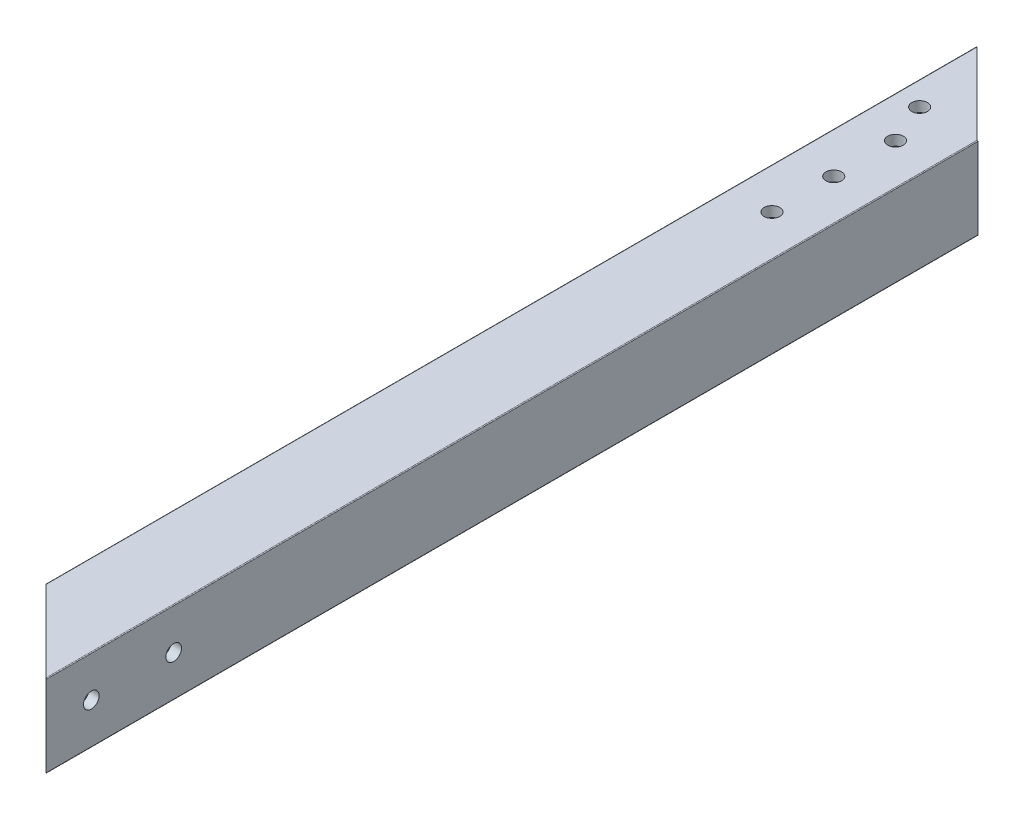
ISO-10303-21;
HEADER;
FILE_DESCRIPTION(('STEP AP214'),'2;1');
FILE_NAME('part.step','',(''),(''),'','','');
FILE_SCHEMA(('AUTOMOTIVE_DESIGN { 1 0 10303 214 1 1 1 1 }'));
ENDSEC;
DATA;
#1=APPLICATION_CONTEXT('core data for automotive mechanical design processes');
#2=APPLICATION_PROTOCOL_DEFINITION('international standard','automotive_design',2000,#1);
#3=PRODUCT_CONTEXT('',#1,'mechanical');
#4=PRODUCT('Part','Part','',(#3));
#5=PRODUCT_RELATED_PRODUCT_CATEGORY('part','',(#4));
#6=PRODUCT_DEFINITION_FORMATION('','',#4);
#7=PRODUCT_DEFINITION_CONTEXT('part definition',#1,'design');
#8=PRODUCT_DEFINITION('design','',#6,#7);
#9=PRODUCT_DEFINITION_SHAPE('','',#8);
#10=(LENGTH_UNIT() NAMED_UNIT(*) SI_UNIT(.MILLI.,.METRE.));
#11=(NAMED_UNIT(*) PLANE_ANGLE_UNIT() SI_UNIT($,.RADIAN.));
#12=(NAMED_UNIT(*) SI_UNIT($,.STERADIAN.) SOLID_ANGLE_UNIT());
#13=UNCERTAINTY_MEASURE_WITH_UNIT(LENGTH_MEASURE(1.E-05),#10,'distance_accuracy_value','');
#14=(GEOMETRIC_REPRESENTATION_CONTEXT(3) GLOBAL_UNCERTAINTY_ASSIGNED_CONTEXT((#13)) GLOBAL_UNIT_ASSIGNED_CONTEXT((#10,
#11,#12)) REPRESENTATION_CONTEXT('',''));
#15=CARTESIAN_POINT('',(0.,0.,0.));
#16=DIRECTION('',(0.,0.,1.));
#17=DIRECTION('',(1.,0.,0.));
#18=AXIS2_PLACEMENT_3D('',#15,#16,#17);
#19=CARTESIAN_POINT('',(3.175,4.7625,1828.8));
#20=DIRECTION('',(1.,0.,0.));
#21=DIRECTION('',(0.,1.,0.));
#22=AXIS2_PLACEMENT_3D('',#19,#20,#21);
#23=PLANE('',#22);
#24=DIRECTION('',(0.,1.,0.));
#25=VECTOR('',#24,1.);
#26=CARTESIAN_POINT('',(3.175,4.7625,1806.575));
#27=LINE('',#26,#25);
#28=CARTESIAN_POINT('',(3.175,4.7625,1806.575));
#29=VERTEX_POINT('',#28);
#30=CARTESIAN_POINT('',(3.175,20.6375,1806.575));
#31=VERTEX_POINT('',#30);
#32=EDGE_CURVE('E322',#29,#31,#27,.T.);
#33=ORIENTED_EDGE('',*,*,#32,.F.);
#34=DIRECTION('',(0.,0.,-1.));
#35=VECTOR('',#34,1.);
#36=CARTESIAN_POINT('',(3.175,4.7625,1828.8));
#37=LINE('',#36,#35);
#38=CARTESIAN_POINT('',(3.175,4.7625,1519.555));
#39=VERTEX_POINT('',#38);
#40=EDGE_CURVE('E70',#29,#39,#37,.T.);
#41=ORIENTED_EDGE('',*,*,#40,.T.);
#42=DIRECTION('',(0.,-1.,0.));
#43=VECTOR('',#42,1.);
#44=CARTESIAN_POINT('',(3.175,4.7625,1519.555));
#45=LINE('',#44,#43);
#46=CARTESIAN_POINT('',(3.175,20.6375,1519.555));
#47=VERTEX_POINT('',#46);
#48=EDGE_CURVE('E268',#47,#39,#45,.T.);
#49=ORIENTED_EDGE('',*,*,#48,.F.);
#50=DIRECTION('',(0.,0.,-1.));
#51=VECTOR('',#50,1.);
#52=CARTESIAN_POINT('',(3.175,20.6375,1828.8));
#53=LINE('',#52,#51);
#54=EDGE_CURVE('E55',#31,#47,#53,.T.);
#55=ORIENTED_EDGE('',*,*,#54,.F.);
#56=EDGE_LOOP('',(#33,#41,#49,#55));
#57=FACE_BOUND('',#56,.T.);
#58=ADVANCED_FACE('F47',(#57),#23,.T.);
#59=CARTESIAN_POINT('',(4.7625,20.6375,1828.8));
#60=DIRECTION('',(0.,0.,-1.));
#61=DIRECTION('',(-1.,0.,0.));
#62=AXIS2_PLACEMENT_3D('',#59,#60,#61);
#63=CYLINDRICAL_SURFACE('',#62,1.5875);
#64=DIRECTION('',(0.,0.,-1.));
#65=VECTOR('',#64,1.);
#66=CARTESIAN_POINT('',(4.7625,22.225,1828.8));
#67=LINE('',#66,#65);
#68=CARTESIAN_POINT('',(4.7625,22.225,1808.1625));
#69=VERTEX_POINT('',#68);
#70=CARTESIAN_POINT('',(4.7625,22.225,1521.1425));
#71=VERTEX_POINT('',#70);
#72=EDGE_CURVE('E225',#69,#71,#67,.T.);
#73=ORIENTED_EDGE('',*,*,#72,.F.);
#74=CARTESIAN_POINT('',(4.7625,20.6375,1808.1625));
#75=DIRECTION('',(0.707106781186545,0.,-0.70710678118655));
#76=DIRECTION('',(-0.70710678118655,0.,-0.707106781186545));
#77=AXIS2_PLACEMENT_3D('',#74,#75,#76);
#78=ELLIPSE('',#77,2.24506403026728,1.5875);
#79=EDGE_CURVE('E315',#69,#31,#78,.F.);
#80=ORIENTED_EDGE('',*,*,#79,.T.);
#81=ORIENTED_EDGE('',*,*,#54,.T.);
#82=CARTESIAN_POINT('',(4.7625,20.6375,1521.1425));
#83=DIRECTION('',(-0.707106781186544,0.,0.707106781186551));
#84=DIRECTION('',(-0.707106781186551,0.,-0.707106781186544));
#85=AXIS2_PLACEMENT_3D('',#82,#83,#84);
#86=ELLIPSE('',#85,2.24506403026728,1.5875);
#87=EDGE_CURVE('E261',#47,#71,#86,.F.);
#88=ORIENTED_EDGE('',*,*,#87,.T.);
#89=EDGE_LOOP('',(#73,#80,#81,#88));
#90=FACE_BOUND('',#89,.T.);
#91=ADVANCED_FACE('F266',(#90),#63,.F.);
#92=CARTESIAN_POINT('',(4.7625,22.225,1828.8));
#93=DIRECTION('',(0.,-1.,0.));
#94=DIRECTION('',(0.,0.,-1.));
#95=AXIS2_PLACEMENT_3D('',#92,#93,#94);
#96=PLANE('',#95);
#97=CARTESIAN_POINT('',(7.43948775786736,22.225,1541.43180412579));
#98=DIRECTION('',(0.,-1.,0.));
#99=DIRECTION('',(0.,0.,-1.));
#100=AXIS2_PLACEMENT_3D('',#97,#98,#99);
#101=CIRCLE('',#100,2.41299999999992);
#102=CARTESIAN_POINT('',(7.43948775786736,22.225,1539.01880412579));
#103=VERTEX_POINT('',#102);
#104=EDGE_CURVE('E527',#103,#103,#101,.T.);
#105=ORIENTED_EDGE('',*,*,#104,.F.);
#106=EDGE_LOOP('',(#105));
#107=FACE_BOUND('',#106,.T.);
#108=CARTESIAN_POINT('',(12.7000000000056,22.225,1554.13180412579));
#109=DIRECTION('',(0.,-1.,0.));
#110=DIRECTION('',(0.,0.,-1.));
#111=AXIS2_PLACEMENT_3D('',#108,#109,#110);
#112=CIRCLE('',#111,2.41300000000005);
#113=CARTESIAN_POINT('',(12.7000000000056,22.225,1551.71880412579));
#114=VERTEX_POINT('',#113);
#115=EDGE_CURVE('E521',#114,#114,#112,.T.);
#116=ORIENTED_EDGE('',*,*,#115,.F.);
#117=EDGE_LOOP('',(#116));
#118=FACE_BOUND('',#117,.T.);
#119=CARTESIAN_POINT('',(12.7000000000055,22.225,1573.18180412579));
#120=DIRECTION('',(0.,-1.,0.));
#121=DIRECTION('',(0.,0.,-1.));
#122=AXIS2_PLACEMENT_3D('',#119,#120,#121);
#123=CIRCLE('',#122,2.413);
#124=CARTESIAN_POINT('',(12.7000000000055,22.225,1570.76880412579));
#125=VERTEX_POINT('',#124);
#126=EDGE_CURVE('E515',#125,#125,#123,.T.);
#127=ORIENTED_EDGE('',*,*,#126,.F.);
#128=EDGE_LOOP('',(#127));
#129=FACE_BOUND('',#128,.T.);
#130=CARTESIAN_POINT('',(12.7000000000054,22.225,1592.23180412579));
#131=DIRECTION('',(0.,-1.,0.));
#132=DIRECTION('',(0.,0.,-1.));
#133=AXIS2_PLACEMENT_3D('',#130,#131,#132);
#134=CIRCLE('',#133,2.41300000000008);
#135=CARTESIAN_POINT('',(12.7000000000054,22.225,1589.81880412579));
#136=VERTEX_POINT('',#135);
#137=EDGE_CURVE('E509',#136,#136,#134,.T.);
#138=ORIENTED_EDGE('',*,*,#137,.F.);
#139=EDGE_LOOP('',(#138));
#140=FACE_BOUND('',#139,.T.);
#141=DIRECTION('',(0.70710678118655,0.,0.707106781186545));
#142=VECTOR('',#141,1.);
#143=CARTESIAN_POINT('',(15.08125,22.225,1818.48125));
#144=LINE('',#143,#142);
#145=CARTESIAN_POINT('',(20.6375,22.225,1824.0375));
#146=VERTEX_POINT('',#145);
#147=EDGE_CURVE('E252',#69,#146,#144,.T.);
#148=ORIENTED_EDGE('',*,*,#147,.F.);
#149=ORIENTED_EDGE('',*,*,#72,.T.);
#150=DIRECTION('',(-0.707106781186551,0.,-0.707106781186544));
#151=VECTOR('',#150,1.);
#152=CARTESIAN_POINT('',(158.59125,22.225,1674.97125));
#153=LINE('',#152,#151);
#154=CARTESIAN_POINT('',(20.6375,22.225,1537.0175));
#155=VERTEX_POINT('',#154);
#156=EDGE_CURVE('E251',#155,#71,#153,.T.);
#157=ORIENTED_EDGE('',*,*,#156,.F.);
#158=DIRECTION('',(0.,0.,-1.));
#159=VECTOR('',#158,1.);
#160=CARTESIAN_POINT('',(20.6375,22.225,1828.8));
#161=LINE('',#160,#159);
#162=EDGE_CURVE('E242',#146,#155,#161,.T.);
#163=ORIENTED_EDGE('',*,*,#162,.F.);
#164=EDGE_LOOP('',(#148,#149,#157,#163));
#165=FACE_BOUND('',#164,.T.);
#166=ADVANCED_FACE('F249',(#107,#118,#129,#140,#165),#96,.T.);
#167=CARTESIAN_POINT('',(20.6375,20.6375,1828.8));
#168=DIRECTION('',(0.,0.,-1.));
#169=DIRECTION('',(-1.,0.,0.));
#170=AXIS2_PLACEMENT_3D('',#167,#168,#169);
#171=CYLINDRICAL_SURFACE('',#170,1.5875);
#172=DIRECTION('',(0.,0.,-1.));
#173=VECTOR('',#172,1.);
#174=CARTESIAN_POINT('',(22.225,20.6375,1828.8));
#175=LINE('',#174,#173);
#176=CARTESIAN_POINT('',(22.225,20.6375,1825.625));
#177=VERTEX_POINT('',#176);
#178=CARTESIAN_POINT('',(22.225,20.6375,1538.605));
#179=VERTEX_POINT('',#178);
#180=EDGE_CURVE('E200',#177,#179,#175,.T.);
#181=ORIENTED_EDGE('',*,*,#180,.F.);
#182=CARTESIAN_POINT('',(20.6375,20.6375,1824.0375));
#183=DIRECTION('',(0.707106781186545,0.,-0.70710678118655));
#184=DIRECTION('',(-0.70710678118655,0.,-0.707106781186545));
#185=AXIS2_PLACEMENT_3D('',#182,#183,#184);
#186=ELLIPSE('',#185,2.24506403026728,1.5875);
#187=EDGE_CURVE('E311',#177,#146,#186,.F.);
#188=ORIENTED_EDGE('',*,*,#187,.T.);
#189=ORIENTED_EDGE('',*,*,#162,.T.);
#190=CARTESIAN_POINT('',(20.6375,20.6375,1537.0175));
#191=DIRECTION('',(-0.707106781186544,0.,0.707106781186551));
#192=DIRECTION('',(-0.707106781186551,0.,-0.707106781186544));
#193=AXIS2_PLACEMENT_3D('',#190,#191,#192);
#194=ELLIPSE('',#193,2.24506403026728,1.5875);
#195=EDGE_CURVE('E264',#155,#179,#194,.F.);
#196=ORIENTED_EDGE('',*,*,#195,.T.);
#197=EDGE_LOOP('',(#181,#188,#189,#196));
#198=FACE_BOUND('',#197,.T.);
#199=ADVANCED_FACE('F309',(#198),#171,.F.);
#200=CARTESIAN_POINT('',(22.225,4.7625,1828.8));
#201=DIRECTION('',(-1.,0.,0.));
#202=DIRECTION('',(0.,0.,1.));
#203=AXIS2_PLACEMENT_3D('',#200,#201,#202);
#204=PLANE('',#203);
#205=CARTESIAN_POINT('',(22.225,12.7,1814.83));
#206=DIRECTION('',(-1.,0.,0.));
#207=DIRECTION('',(0.,0.,1.));
#208=AXIS2_PLACEMENT_3D('',#205,#206,#207);
#209=CIRCLE('',#208,2.4130000000001);
#210=CARTESIAN_POINT('',(22.225,12.7,1817.243));
#211=VERTEX_POINT('',#210);
#212=EDGE_CURVE('E478',#211,#211,#209,.F.);
#213=ORIENTED_EDGE('',*,*,#212,.T.);
#214=EDGE_LOOP('',(#213));
#215=FACE_BOUND('',#214,.T.);
#216=CARTESIAN_POINT('',(22.225,12.7,1789.43));
#217=DIRECTION('',(-1.,0.,0.));
#218=DIRECTION('',(0.,0.,1.));
#219=AXIS2_PLACEMENT_3D('',#216,#217,#218);
#220=CIRCLE('',#219,2.4130000000001);
#221=CARTESIAN_POINT('',(22.225,12.7,1791.843));
#222=VERTEX_POINT('',#221);
#223=EDGE_CURVE('E455',#222,#222,#220,.F.);
#224=ORIENTED_EDGE('',*,*,#223,.T.);
#225=EDGE_LOOP('',(#224));
#226=FACE_BOUND('',#225,.T.);
#227=DIRECTION('',(0.,-1.,0.));
#228=VECTOR('',#227,1.);
#229=CARTESIAN_POINT('',(22.225,4.7625,1825.625));
#230=LINE('',#229,#228);
#231=CARTESIAN_POINT('',(22.225,4.7625,1825.625));
#232=VERTEX_POINT('',#231);
#233=EDGE_CURVE('E313',#177,#232,#230,.T.);
#234=ORIENTED_EDGE('',*,*,#233,.F.);
#235=ORIENTED_EDGE('',*,*,#180,.T.);
#236=DIRECTION('',(0.,1.,0.));
#237=VECTOR('',#236,1.);
#238=CARTESIAN_POINT('',(22.225,4.7625,1538.605));
#239=LINE('',#238,#237);
#240=CARTESIAN_POINT('',(22.225,4.7625,1538.605));
#241=VERTEX_POINT('',#240);
#242=EDGE_CURVE('E306',#241,#179,#239,.T.);
#243=ORIENTED_EDGE('',*,*,#242,.F.);
#244=DIRECTION('',(0.,0.,-1.));
#245=VECTOR('',#244,1.);
#246=CARTESIAN_POINT('',(22.225,4.7625,1828.8));
#247=LINE('',#246,#245);
#248=EDGE_CURVE('E209',#232,#241,#247,.T.);
#249=ORIENTED_EDGE('',*,*,#248,.F.);
#250=EDGE_LOOP('',(#234,#235,#243,#249));
#251=FACE_BOUND('',#250,.T.);
#252=ADVANCED_FACE('F357',(#215,#226,#251),#204,.T.);
#253=CARTESIAN_POINT('',(20.6375,4.7625,1828.8));
#254=DIRECTION('',(0.,0.,-1.));
#255=DIRECTION('',(-1.,0.,0.));
#256=AXIS2_PLACEMENT_3D('',#253,#254,#255);
#257=CYLINDRICAL_SURFACE('',#256,1.5875);
#258=DIRECTION('',(0.,0.,-1.));
#259=VECTOR('',#258,1.);
#260=CARTESIAN_POINT('',(20.6375,3.175,1828.8));
#261=LINE('',#260,#259);
#262=CARTESIAN_POINT('',(20.6375,3.175,1824.0375));
#263=VERTEX_POINT('',#262);
#264=CARTESIAN_POINT('',(20.6375,3.175,1537.0175));
#265=VERTEX_POINT('',#264);
#266=EDGE_CURVE('E208',#263,#265,#261,.T.);
#267=ORIENTED_EDGE('',*,*,#266,.F.);
#268=CARTESIAN_POINT('',(20.6375,4.7625,1824.0375));
#269=DIRECTION('',(0.707106781186545,0.,-0.70710678118655));
#270=DIRECTION('',(-0.70710678118655,0.,-0.707106781186545));
#271=AXIS2_PLACEMENT_3D('',#268,#269,#270);
#272=ELLIPSE('',#271,2.24506403026728,1.5875);
#273=EDGE_CURVE('E317',#263,#232,#272,.F.);
#274=ORIENTED_EDGE('',*,*,#273,.T.);
#275=ORIENTED_EDGE('',*,*,#248,.T.);
#276=CARTESIAN_POINT('',(20.6375,4.7625,1537.0175));
#277=DIRECTION('',(-0.707106781186544,0.,0.707106781186551));
#278=DIRECTION('',(-0.707106781186551,0.,-0.707106781186544));
#279=AXIS2_PLACEMENT_3D('',#276,#277,#278);
#280=ELLIPSE('',#279,2.24506403026728,1.5875);
#281=EDGE_CURVE('E303',#241,#265,#280,.F.);
#282=ORIENTED_EDGE('',*,*,#281,.T.);
#283=EDGE_LOOP('',(#267,#274,#275,#282));
#284=FACE_BOUND('',#283,.T.);
#285=ADVANCED_FACE('F353',(#284),#257,.F.);
#286=CARTESIAN_POINT('',(4.7625,3.175,1828.8));
#287=DIRECTION('',(0.,1.,0.));
#288=DIRECTION('',(1.,0.,0.));
#289=AXIS2_PLACEMENT_3D('',#286,#287,#288);
#290=PLANE('',#289);
#291=CARTESIAN_POINT('',(12.7,3.175,1789.15923163679));
#292=DIRECTION('',(0.,1.,0.));
#293=DIRECTION('',(0.,0.,1.));
#294=AXIS2_PLACEMENT_3D('',#291,#292,#293);
#295=CIRCLE('',#294,2.41299999999999);
#296=CARTESIAN_POINT('',(12.7,3.175,1791.57223163679));
#297=VERTEX_POINT('',#296);
#298=EDGE_CURVE('E451',#297,#297,#295,.F.);
#299=ORIENTED_EDGE('',*,*,#298,.T.);
#300=EDGE_LOOP('',(#299));
#301=FACE_BOUND('',#300,.T.);
#302=CARTESIAN_POINT('',(12.7,3.175,1712.95923163679));
#303=DIRECTION('',(0.,1.,0.));
#304=DIRECTION('',(0.,0.,1.));
#305=AXIS2_PLACEMENT_3D('',#302,#303,#304);
#306=CIRCLE('',#305,2.413);
#307=CARTESIAN_POINT('',(12.7,3.175,1715.37223163679));
#308=VERTEX_POINT('',#307);
#309=EDGE_CURVE('E463',#308,#308,#306,.F.);
#310=ORIENTED_EDGE('',*,*,#309,.T.);
#311=EDGE_LOOP('',(#310));
#312=FACE_BOUND('',#311,.T.);
#313=CARTESIAN_POINT('',(12.7,3.175,1636.75923163679));
#314=DIRECTION('',(0.,1.,0.));
#315=DIRECTION('',(0.,0.,1.));
#316=AXIS2_PLACEMENT_3D('',#313,#314,#315);
#317=CIRCLE('',#316,2.413);
#318=CARTESIAN_POINT('',(12.7,3.175,1639.17223163679));
#319=VERTEX_POINT('',#318);
#320=EDGE_CURVE('E469',#319,#319,#317,.F.);
#321=ORIENTED_EDGE('',*,*,#320,.T.);
#322=EDGE_LOOP('',(#321));
#323=FACE_BOUND('',#322,.T.);
#324=CARTESIAN_POINT('',(7.43948775786736,3.175,1541.43180412579));
#325=DIRECTION('',(0.,1.,0.));
#326=DIRECTION('',(0.,0.,1.));
#327=AXIS2_PLACEMENT_3D('',#324,#325,#326);
#328=CIRCLE('',#327,2.41299999999992);
#329=CARTESIAN_POINT('',(7.43948775786736,3.175,1543.84480412579));
#330=VERTEX_POINT('',#329);
#331=EDGE_CURVE('E524',#330,#330,#328,.T.);
#332=ORIENTED_EDGE('',*,*,#331,.F.);
#333=EDGE_LOOP('',(#332));
#334=FACE_BOUND('',#333,.T.);
#335=CARTESIAN_POINT('',(12.7000000000056,3.175,1554.13180412579));
#336=DIRECTION('',(0.,1.,0.));
#337=DIRECTION('',(0.,0.,1.));
#338=AXIS2_PLACEMENT_3D('',#335,#336,#337);
#339=CIRCLE('',#338,2.41300000000005);
#340=CARTESIAN_POINT('',(12.7000000000056,3.175,1556.54480412579));
#341=VERTEX_POINT('',#340);
#342=EDGE_CURVE('E518',#341,#341,#339,.T.);
#343=ORIENTED_EDGE('',*,*,#342,.F.);
#344=EDGE_LOOP('',(#343));
#345=FACE_BOUND('',#344,.T.);
#346=CARTESIAN_POINT('',(12.7000000000055,3.175,1573.18180412579));
#347=DIRECTION('',(0.,1.,0.));
#348=DIRECTION('',(0.,0.,1.));
#349=AXIS2_PLACEMENT_3D('',#346,#347,#348);
#350=CIRCLE('',#349,2.413);
#351=CARTESIAN_POINT('',(12.7000000000055,3.175,1575.59480412579));
#352=VERTEX_POINT('',#351);
#353=EDGE_CURVE('E512',#352,#352,#350,.T.);
#354=ORIENTED_EDGE('',*,*,#353,.F.);
#355=EDGE_LOOP('',(#354));
#356=FACE_BOUND('',#355,.T.);
#357=CARTESIAN_POINT('',(12.7000000000054,3.175,1592.23180412579));
#358=DIRECTION('',(0.,1.,0.));
#359=DIRECTION('',(0.,0.,1.));
#360=AXIS2_PLACEMENT_3D('',#357,#358,#359);
#361=CIRCLE('',#360,2.41300000000008);
#362=CARTESIAN_POINT('',(12.7000000000054,3.175,1594.64480412579));
#363=VERTEX_POINT('',#362);
#364=EDGE_CURVE('E486',#363,#363,#361,.T.);
#365=ORIENTED_EDGE('',*,*,#364,.F.);
#366=EDGE_LOOP('',(#365));
#367=FACE_BOUND('',#366,.T.);
#368=DIRECTION('',(-0.70710678118655,0.,-0.707106781186545));
#369=VECTOR('',#368,1.);
#370=CARTESIAN_POINT('',(15.08125,3.175,1818.48125));
#371=LINE('',#370,#369);
#372=CARTESIAN_POINT('',(4.7625,3.175,1808.1625));
#373=VERTEX_POINT('',#372);
#374=EDGE_CURVE('E62',#263,#373,#371,.T.);
#375=ORIENTED_EDGE('',*,*,#374,.F.);
#376=ORIENTED_EDGE('',*,*,#266,.T.);
#377=DIRECTION('',(0.707106781186551,0.,0.707106781186544));
#378=VECTOR('',#377,1.);
#379=CARTESIAN_POINT('',(158.59125,3.175,1674.97125));
#380=LINE('',#379,#378);
#381=CARTESIAN_POINT('',(4.7625,3.175,1521.1425));
#382=VERTEX_POINT('',#381);
#383=EDGE_CURVE('E301',#382,#265,#380,.T.);
#384=ORIENTED_EDGE('',*,*,#383,.F.);
#385=DIRECTION('',(0.,0.,-1.));
#386=VECTOR('',#385,1.);
#387=CARTESIAN_POINT('',(4.7625,3.175,1828.8));
#388=LINE('',#387,#386);
#389=EDGE_CURVE('E210',#373,#382,#388,.T.);
#390=ORIENTED_EDGE('',*,*,#389,.F.);
#391=EDGE_LOOP('',(#375,#376,#384,#390));
#392=FACE_BOUND('',#391,.T.);
#393=ADVANCED_FACE('F358',(#301,#312,#323,#334,#345,#356,#367,#392),#290,.T.);
#394=CARTESIAN_POINT('',(4.7625,4.7625,1828.8));
#395=DIRECTION('',(0.,0.,-1.));
#396=DIRECTION('',(-1.,0.,0.));
#397=AXIS2_PLACEMENT_3D('',#394,#395,#396);
#398=CYLINDRICAL_SURFACE('',#397,1.5875);
#399=ORIENTED_EDGE('',*,*,#40,.F.);
#400=CARTESIAN_POINT('',(4.7625,4.7625,1808.1625));
#401=DIRECTION('',(0.707106781186545,0.,-0.70710678118655));
#402=DIRECTION('',(-0.70710678118655,0.,-0.707106781186545));
#403=AXIS2_PLACEMENT_3D('',#400,#401,#402);
#404=ELLIPSE('',#403,2.24506403026728,1.5875);
#405=EDGE_CURVE('E348',#29,#373,#404,.F.);
#406=ORIENTED_EDGE('',*,*,#405,.T.);
#407=ORIENTED_EDGE('',*,*,#389,.T.);
#408=CARTESIAN_POINT('',(4.7625,4.7625,1521.1425));
#409=DIRECTION('',(-0.707106781186544,0.,0.707106781186551));
#410=DIRECTION('',(-0.707106781186551,0.,-0.707106781186544));
#411=AXIS2_PLACEMENT_3D('',#408,#409,#410);
#412=ELLIPSE('',#411,2.24506403026728,1.5875);
#413=EDGE_CURVE('E299',#382,#39,#412,.F.);
#414=ORIENTED_EDGE('',*,*,#413,.T.);
#415=EDGE_LOOP('',(#399,#406,#407,#414));
#416=FACE_BOUND('',#415,.T.);
#417=ADVANCED_FACE('F360',(#416),#398,.F.);
#418=CARTESIAN_POINT('',(0.,0.254,1828.8));
#419=DIRECTION('',(1.,0.,0.));
#420=DIRECTION('',(0.,1.,0.));
#421=AXIS2_PLACEMENT_3D('',#418,#419,#420);
#422=PLANE('',#421);
#423=DIRECTION('',(0.,0.,-1.));
#424=VECTOR('',#423,1.);
#425=CARTESIAN_POINT('',(0.,0.254,1828.8));
#426=LINE('',#425,#424);
#427=CARTESIAN_POINT('',(0.,0.254,1803.4));
#428=VERTEX_POINT('',#427);
#429=CARTESIAN_POINT('',(0.,0.254,1516.38));
#430=VERTEX_POINT('',#429);
#431=EDGE_CURVE('E192',#428,#430,#426,.T.);
#432=ORIENTED_EDGE('',*,*,#431,.F.);
#433=DIRECTION('',(0.,1.,0.));
#434=VECTOR('',#433,1.);
#435=CARTESIAN_POINT('',(0.,0.254,1803.4));
#436=LINE('',#435,#434);
#437=CARTESIAN_POINT('',(0.,25.1460000000001,1803.4));
#438=VERTEX_POINT('',#437);
#439=EDGE_CURVE('E173',#428,#438,#436,.T.);
#440=ORIENTED_EDGE('',*,*,#439,.T.);
#441=DIRECTION('',(0.,0.,-1.));
#442=VECTOR('',#441,1.);
#443=CARTESIAN_POINT('',(0.,25.146,1828.8));
#444=LINE('',#443,#442);
#445=CARTESIAN_POINT('',(0.,25.1460000000001,1516.38));
#446=VERTEX_POINT('',#445);
#447=EDGE_CURVE('E207',#438,#446,#444,.T.);
#448=ORIENTED_EDGE('',*,*,#447,.T.);
#449=DIRECTION('',(0.,-1.,0.));
#450=VECTOR('',#449,1.);
#451=CARTESIAN_POINT('',(0.,0.254,1516.38));
#452=LINE('',#451,#450);
#453=EDGE_CURVE('E197',#446,#430,#452,.T.);
#454=ORIENTED_EDGE('',*,*,#453,.T.);
#455=EDGE_LOOP('',(#432,#440,#448,#454));
#456=FACE_BOUND('',#455,.T.);
#457=ADVANCED_FACE('F279',(#456),#422,.F.);
#458=CARTESIAN_POINT('',(0.254,25.146,1828.8));
#459=DIRECTION('',(0.,0.,-1.));
#460=DIRECTION('',(-1.,0.,0.));
#461=AXIS2_PLACEMENT_3D('',#458,#459,#460);
#462=CYLINDRICAL_SURFACE('',#461,0.254);
#463=CARTESIAN_POINT('',(0.254,25.146,1803.654));
#464=DIRECTION('',(0.707106781186545,0.,-0.70710678118655));
#465=DIRECTION('',(-0.70710678118655,0.,-0.707106781186545));
#466=AXIS2_PLACEMENT_3D('',#463,#464,#465);
#467=ELLIPSE('',#466,0.359210244842765,0.254);
#468=CARTESIAN_POINT('',(0.253999999999976,25.4,1803.654));
#469=VERTEX_POINT('',#468);
#470=EDGE_CURVE('E345',#469,#438,#467,.F.);
#471=ORIENTED_EDGE('',*,*,#470,.F.);
#472=DIRECTION('',(0.,0.,-1.));
#473=VECTOR('',#472,1.);
#474=CARTESIAN_POINT('',(0.254,25.4,1828.8));
#475=LINE('',#474,#473);
#476=CARTESIAN_POINT('',(0.25399999999999,25.4,1516.634));
#477=VERTEX_POINT('',#476);
#478=EDGE_CURVE('E204',#469,#477,#475,.T.);
#479=ORIENTED_EDGE('',*,*,#478,.T.);
#480=CARTESIAN_POINT('',(0.254,25.146,1516.634));
#481=DIRECTION('',(-0.707106781186544,0.,0.707106781186551));
#482=DIRECTION('',(-0.707106781186551,0.,-0.707106781186544));
#483=AXIS2_PLACEMENT_3D('',#480,#481,#482);
#484=ELLIPSE('',#483,0.359210244842764,0.254);
#485=EDGE_CURVE('E284',#446,#477,#484,.F.);
#486=ORIENTED_EDGE('',*,*,#485,.F.);
#487=ORIENTED_EDGE('',*,*,#447,.F.);
#488=EDGE_LOOP('',(#471,#479,#486,#487));
#489=FACE_BOUND('',#488,.T.);
#490=ADVANCED_FACE('F288',(#489),#462,.T.);
#491=CARTESIAN_POINT('',(0.254,25.4,1828.8));
#492=DIRECTION('',(0.,-1.,0.));
#493=DIRECTION('',(0.,0.,-1.));
#494=AXIS2_PLACEMENT_3D('',#491,#492,#493);
#495=PLANE('',#494);
#496=CARTESIAN_POINT('',(7.43948775786736,25.4,1541.43180412579));
#497=DIRECTION('',(0.,-1.,0.));
#498=DIRECTION('',(0.,0.,-1.));
#499=AXIS2_PLACEMENT_3D('',#496,#497,#498);
#500=CIRCLE('',#499,2.41299999999992);
#501=CARTESIAN_POINT('',(7.43948775786736,25.4,1539.01880412579));
#502=VERTEX_POINT('',#501);
#503=EDGE_CURVE('E483',#502,#502,#500,.T.);
#504=ORIENTED_EDGE('',*,*,#503,.T.);
#505=EDGE_LOOP('',(#504));
#506=FACE_BOUND('',#505,.T.);
#507=CARTESIAN_POINT('',(12.7000000000056,25.4,1554.13180412579));
#508=DIRECTION('',(0.,-1.,0.));
#509=DIRECTION('',(0.,0.,-1.));
#510=AXIS2_PLACEMENT_3D('',#507,#508,#509);
#511=CIRCLE('',#510,2.41300000000005);
#512=CARTESIAN_POINT('',(12.7000000000056,25.4,1551.71880412579));
#513=VERTEX_POINT('',#512);
#514=EDGE_CURVE('E490',#513,#513,#511,.T.);
#515=ORIENTED_EDGE('',*,*,#514,.T.);
#516=EDGE_LOOP('',(#515));
#517=FACE_BOUND('',#516,.T.);
#518=CARTESIAN_POINT('',(12.7000000000055,25.4,1573.18180412579));
#519=DIRECTION('',(0.,-1.,0.));
#520=DIRECTION('',(0.,0.,-1.));
#521=AXIS2_PLACEMENT_3D('',#518,#519,#520);
#522=CIRCLE('',#521,2.413);
#523=CARTESIAN_POINT('',(12.7000000000055,25.4,1570.76880412579));
#524=VERTEX_POINT('',#523);
#525=EDGE_CURVE('E496',#524,#524,#522,.T.);
#526=ORIENTED_EDGE('',*,*,#525,.T.);
#527=EDGE_LOOP('',(#526));
#528=FACE_BOUND('',#527,.T.);
#529=CARTESIAN_POINT('',(12.7000000000054,25.4,1592.23180412579));
#530=DIRECTION('',(0.,-1.,0.));
#531=DIRECTION('',(0.,0.,-1.));
#532=AXIS2_PLACEMENT_3D('',#529,#530,#531);
#533=CIRCLE('',#532,2.41300000000008);
#534=CARTESIAN_POINT('',(12.7000000000054,25.4,1589.81880412579));
#535=VERTEX_POINT('',#534);
#536=EDGE_CURVE('E502',#535,#535,#533,.T.);
#537=ORIENTED_EDGE('',*,*,#536,.T.);
#538=EDGE_LOOP('',(#537));
#539=FACE_BOUND('',#538,.T.);
#540=ORIENTED_EDGE('',*,*,#478,.F.);
#541=DIRECTION('',(-0.70710678118655,0.,-0.707106781186545));
#542=VECTOR('',#541,1.);
#543=CARTESIAN_POINT('',(34.1927663058368,25.4,1837.59276630584));
#544=LINE('',#543,#542);
#545=CARTESIAN_POINT('',(25.146,25.4,1828.546));
#546=VERTEX_POINT('',#545);
#547=EDGE_CURVE('E186',#546,#469,#544,.T.);
#548=ORIENTED_EDGE('',*,*,#547,.F.);
#549=DIRECTION('',(0.,0.,-1.));
#550=VECTOR('',#549,1.);
#551=CARTESIAN_POINT('',(25.146,25.4,1828.8));
#552=LINE('',#551,#550);
#553=CARTESIAN_POINT('',(25.146,25.4,1541.526));
#554=VERTEX_POINT('',#553);
#555=EDGE_CURVE('E202',#546,#554,#552,.T.);
#556=ORIENTED_EDGE('',*,*,#555,.T.);
#557=DIRECTION('',(0.707106781186551,0.,0.707106781186544));
#558=VECTOR('',#557,1.);
#559=CARTESIAN_POINT('',(25.2088679499494,25.4,1541.58886794995));
#560=LINE('',#559,#558);
#561=EDGE_CURVE('E324',#477,#554,#560,.T.);
#562=ORIENTED_EDGE('',*,*,#561,.F.);
#563=EDGE_LOOP('',(#540,#548,#556,#562));
#564=FACE_BOUND('',#563,.T.);
#565=ADVANCED_FACE('F392',(#506,#517,#528,#539,#564),#495,.F.);
#566=CARTESIAN_POINT('',(25.146,25.146,1828.8));
#567=DIRECTION('',(0.,0.,-1.));
#568=DIRECTION('',(-1.,0.,0.));
#569=AXIS2_PLACEMENT_3D('',#566,#567,#568);
#570=CYLINDRICAL_SURFACE('',#569,0.254);
#571=CARTESIAN_POINT('',(25.146,25.146,1828.546));
#572=DIRECTION('',(0.707106781186545,0.,-0.70710678118655));
#573=DIRECTION('',(-0.70710678118655,0.,-0.707106781186545));
#574=AXIS2_PLACEMENT_3D('',#571,#572,#573);
#575=ELLIPSE('',#574,0.359210244842765,0.254);
#576=CARTESIAN_POINT('',(25.4000000000002,25.146,1828.8));
#577=VERTEX_POINT('',#576);
#578=EDGE_CURVE('E338',#577,#546,#575,.F.);
#579=ORIENTED_EDGE('',*,*,#578,.F.);
#580=DIRECTION('',(0.,0.,-1.));
#581=VECTOR('',#580,1.);
#582=CARTESIAN_POINT('',(25.4,25.146,1828.8));
#583=LINE('',#582,#581);
#584=CARTESIAN_POINT('',(25.4,25.146,1541.3977358999));
#585=VERTEX_POINT('',#584);
#586=EDGE_CURVE('E205',#577,#585,#583,.T.);
#587=ORIENTED_EDGE('',*,*,#586,.T.);
#588=CARTESIAN_POINT('',(25.146,25.146,1541.6517358999));
#589=DIRECTION('',(0.707106781186552,0.,0.707106781186543));
#590=DIRECTION('',(0.707106781186543,0.,-0.707106781186552));
#591=AXIS2_PLACEMENT_3D('',#588,#589,#590);
#592=ELLIPSE('',#591,0.359210244842768,0.254);
#593=CARTESIAN_POINT('',(25.2088679499494,25.3920967713506,1541.58886794995));
#594=VERTEX_POINT('',#593);
#595=EDGE_CURVE('E275',#594,#585,#592,.F.);
#596=ORIENTED_EDGE('',*,*,#595,.F.);
#597=CARTESIAN_POINT('',(25.146,25.146,1541.526));
#598=DIRECTION('',(-0.707106781186544,0.,0.707106781186551));
#599=DIRECTION('',(-0.707106781186551,0.,-0.707106781186544));
#600=AXIS2_PLACEMENT_3D('',#597,#598,#599);
#601=ELLIPSE('',#600,0.359210244842764,0.254);
#602=EDGE_CURVE('E292',#554,#594,#601,.F.);
#603=ORIENTED_EDGE('',*,*,#602,.F.);
#604=ORIENTED_EDGE('',*,*,#555,.F.);
#605=EDGE_LOOP('',(#579,#587,#596,#603,#604));
#606=FACE_BOUND('',#605,.T.);
#607=ADVANCED_FACE('F49',(#606),#570,.T.);
#608=CARTESIAN_POINT('',(25.4,0.254,1828.8));
#609=DIRECTION('',(-1.,0.,0.));
#610=DIRECTION('',(0.,0.,1.));
#611=AXIS2_PLACEMENT_3D('',#608,#609,#610);
#612=PLANE('',#611);
#613=CARTESIAN_POINT('',(25.4,12.7,1814.83));
#614=DIRECTION('',(1.,0.,0.));
#615=DIRECTION('',(0.,0.,-1.));
#616=AXIS2_PLACEMENT_3D('',#613,#614,#615);
#617=CIRCLE('',#616,2.4130000000001);
#618=CARTESIAN_POINT('',(25.4,12.7,1812.417));
#619=VERTEX_POINT('',#618);
#620=EDGE_CURVE('E474',#619,#619,#617,.T.);
#621=ORIENTED_EDGE('',*,*,#620,.F.);
#622=EDGE_LOOP('',(#621));
#623=FACE_BOUND('',#622,.T.);
#624=CARTESIAN_POINT('',(25.4,12.7,1789.43));
#625=DIRECTION('',(1.,0.,0.));
#626=DIRECTION('',(0.,0.,-1.));
#627=AXIS2_PLACEMENT_3D('',#624,#625,#626);
#628=CIRCLE('',#627,2.4130000000001);
#629=CARTESIAN_POINT('',(25.4,12.7,1787.017));
#630=VERTEX_POINT('',#629);
#631=EDGE_CURVE('E458',#630,#630,#628,.T.);
#632=ORIENTED_EDGE('',*,*,#631,.F.);
#633=EDGE_LOOP('',(#632));
#634=FACE_BOUND('',#633,.T.);
#635=DIRECTION('',(0.,0.,-1.));
#636=VECTOR('',#635,1.);
#637=CARTESIAN_POINT('',(25.4,0.254,1828.8));
#638=LINE('',#637,#636);
#639=CARTESIAN_POINT('',(25.4,0.254,1828.8));
#640=VERTEX_POINT('',#639);
#641=CARTESIAN_POINT('',(25.4,0.254,1541.3977358999));
#642=VERTEX_POINT('',#641);
#643=EDGE_CURVE('E226',#640,#642,#638,.T.);
#644=ORIENTED_EDGE('',*,*,#643,.T.);
#645=DIRECTION('',(0.,1.,0.));
#646=VECTOR('',#645,1.);
#647=CARTESIAN_POINT('',(25.4,0.254,1541.3977358999));
#648=LINE('',#647,#646);
#649=EDGE_CURVE('E270',#642,#585,#648,.T.);
#650=ORIENTED_EDGE('',*,*,#649,.T.);
#651=ORIENTED_EDGE('',*,*,#586,.F.);
#652=DIRECTION('',(0.,1.,0.));
#653=VECTOR('',#652,1.);
#654=CARTESIAN_POINT('',(25.4,0.254,1828.8));
#655=LINE('',#654,#653);
#656=EDGE_CURVE('E193',#640,#577,#655,.T.);
#657=ORIENTED_EDGE('',*,*,#656,.F.);
#658=EDGE_LOOP('',(#644,#650,#651,#657));
#659=FACE_BOUND('',#658,.T.);
#660=ADVANCED_FACE('F339',(#623,#634,#659),#612,.F.);
#661=CARTESIAN_POINT('',(25.146,0.254,1828.8));
#662=DIRECTION('',(0.,0.,-1.));
#663=DIRECTION('',(-1.,0.,0.));
#664=AXIS2_PLACEMENT_3D('',#661,#662,#663);
#665=CYLINDRICAL_SURFACE('',#664,0.254);
#666=CARTESIAN_POINT('',(25.146,0.254,1828.546));
#667=DIRECTION('',(0.707106781186545,0.,-0.70710678118655));
#668=DIRECTION('',(-0.70710678118655,0.,-0.707106781186545));
#669=AXIS2_PLACEMENT_3D('',#666,#667,#668);
#670=ELLIPSE('',#669,0.359210244842765,0.254);
#671=CARTESIAN_POINT('',(25.146,0.,1828.546));
#672=VERTEX_POINT('',#671);
#673=EDGE_CURVE('E177',#672,#640,#670,.F.);
#674=ORIENTED_EDGE('',*,*,#673,.F.);
#675=DIRECTION('',(0.,0.,-1.));
#676=VECTOR('',#675,1.);
#677=CARTESIAN_POINT('',(25.146,0.,1828.8));
#678=LINE('',#677,#676);
#679=CARTESIAN_POINT('',(25.1460000000001,0.,1541.526));
#680=VERTEX_POINT('',#679);
#681=EDGE_CURVE('E185',#672,#680,#678,.T.);
#682=ORIENTED_EDGE('',*,*,#681,.T.);
#683=CARTESIAN_POINT('',(25.146,0.254,1541.526));
#684=DIRECTION('',(-0.707106781186544,0.,0.707106781186551));
#685=DIRECTION('',(-0.707106781186551,0.,-0.707106781186544));
#686=AXIS2_PLACEMENT_3D('',#683,#684,#685);
#687=ELLIPSE('',#686,0.359210244842764,0.254);
#688=CARTESIAN_POINT('',(25.2088679499494,0.00790322864945014,1541.58886794995));
#689=VERTEX_POINT('',#688);
#690=EDGE_CURVE('E290',#689,#680,#687,.F.);
#691=ORIENTED_EDGE('',*,*,#690,.F.);
#692=CARTESIAN_POINT('',(25.146,0.254,1541.6517358999));
#693=DIRECTION('',(0.707106781186552,0.,0.707106781186543));
#694=DIRECTION('',(0.707106781186543,0.,-0.707106781186552));
#695=AXIS2_PLACEMENT_3D('',#692,#693,#694);
#696=ELLIPSE('',#695,0.359210244842768,0.254);
#697=EDGE_CURVE('E11',#642,#689,#696,.F.);
#698=ORIENTED_EDGE('',*,*,#697,.F.);
#699=ORIENTED_EDGE('',*,*,#643,.F.);
#700=EDGE_LOOP('',(#674,#682,#691,#698,#699));
#701=FACE_BOUND('',#700,.T.);
#702=ADVANCED_FACE('F340',(#701),#665,.T.);
#703=CARTESIAN_POINT('',(0.254,0.,1828.8));
#704=DIRECTION('',(0.,1.,0.));
#705=DIRECTION('',(1.,0.,0.));
#706=AXIS2_PLACEMENT_3D('',#703,#704,#705);
#707=PLANE('',#706);
#708=CARTESIAN_POINT('',(12.7,0.,1789.15923163679));
#709=DIRECTION('',(0.,-1.,0.));
#710=DIRECTION('',(0.,0.,-1.));
#711=AXIS2_PLACEMENT_3D('',#708,#709,#710);
#712=CIRCLE('',#711,2.41299999999999);
#713=CARTESIAN_POINT('',(12.7,0.,1786.74623163679));
#714=VERTEX_POINT('',#713);
#715=EDGE_CURVE('E454',#714,#714,#712,.T.);
#716=ORIENTED_EDGE('',*,*,#715,.F.);
#717=EDGE_LOOP('',(#716));
#718=FACE_BOUND('',#717,.T.);
#719=CARTESIAN_POINT('',(12.7,0.,1712.95923163679));
#720=DIRECTION('',(0.,-1.,0.));
#721=DIRECTION('',(0.,0.,-1.));
#722=AXIS2_PLACEMENT_3D('',#719,#720,#721);
#723=CIRCLE('',#722,2.413);
#724=CARTESIAN_POINT('',(12.7,0.,1710.54623163679));
#725=VERTEX_POINT('',#724);
#726=EDGE_CURVE('E460',#725,#725,#723,.T.);
#727=ORIENTED_EDGE('',*,*,#726,.F.);
#728=EDGE_LOOP('',(#727));
#729=FACE_BOUND('',#728,.T.);
#730=CARTESIAN_POINT('',(12.7,0.,1636.75923163679));
#731=DIRECTION('',(0.,-1.,0.));
#732=DIRECTION('',(0.,0.,-1.));
#733=AXIS2_PLACEMENT_3D('',#730,#731,#732);
#734=CIRCLE('',#733,2.413);
#735=CARTESIAN_POINT('',(12.7,0.,1634.34623163679));
#736=VERTEX_POINT('',#735);
#737=EDGE_CURVE('E466',#736,#736,#734,.T.);
#738=ORIENTED_EDGE('',*,*,#737,.F.);
#739=EDGE_LOOP('',(#738));
#740=FACE_BOUND('',#739,.T.);
#741=CARTESIAN_POINT('',(7.43948775786736,0.,1541.43180412579));
#742=DIRECTION('',(0.,-1.,0.));
#743=DIRECTION('',(0.,0.,-1.));
#744=AXIS2_PLACEMENT_3D('',#741,#742,#743);
#745=CIRCLE('',#744,2.41299999999992);
#746=CARTESIAN_POINT('',(7.43948775786736,0.,1539.01880412579));
#747=VERTEX_POINT('',#746);
#748=EDGE_CURVE('E487',#747,#747,#745,.T.);
#749=ORIENTED_EDGE('',*,*,#748,.F.);
#750=EDGE_LOOP('',(#749));
#751=FACE_BOUND('',#750,.T.);
#752=CARTESIAN_POINT('',(12.7000000000056,0.,1554.13180412579));
#753=DIRECTION('',(0.,-1.,0.));
#754=DIRECTION('',(0.,0.,-1.));
#755=AXIS2_PLACEMENT_3D('',#752,#753,#754);
#756=CIRCLE('',#755,2.41300000000005);
#757=CARTESIAN_POINT('',(12.7000000000056,0.,1551.71880412579));
#758=VERTEX_POINT('',#757);
#759=EDGE_CURVE('E493',#758,#758,#756,.T.);
#760=ORIENTED_EDGE('',*,*,#759,.F.);
#761=EDGE_LOOP('',(#760));
#762=FACE_BOUND('',#761,.T.);
#763=CARTESIAN_POINT('',(12.7000000000055,0.,1573.18180412579));
#764=DIRECTION('',(0.,-1.,0.));
#765=DIRECTION('',(0.,0.,-1.));
#766=AXIS2_PLACEMENT_3D('',#763,#764,#765);
#767=CIRCLE('',#766,2.413);
#768=CARTESIAN_POINT('',(12.7000000000055,0.,1570.76880412579));
#769=VERTEX_POINT('',#768);
#770=EDGE_CURVE('E499',#769,#769,#767,.T.);
#771=ORIENTED_EDGE('',*,*,#770,.F.);
#772=EDGE_LOOP('',(#771));
#773=FACE_BOUND('',#772,.T.);
#774=CARTESIAN_POINT('',(12.7000000000054,0.,1592.23180412579));
#775=DIRECTION('',(0.,-1.,0.));
#776=DIRECTION('',(0.,0.,-1.));
#777=AXIS2_PLACEMENT_3D('',#774,#775,#776);
#778=CIRCLE('',#777,2.41300000000008);
#779=CARTESIAN_POINT('',(12.7000000000054,0.,1589.81880412579));
#780=VERTEX_POINT('',#779);
#781=EDGE_CURVE('E477',#780,#780,#778,.T.);
#782=ORIENTED_EDGE('',*,*,#781,.F.);
#783=EDGE_LOOP('',(#782));
#784=FACE_BOUND('',#783,.T.);
#785=ORIENTED_EDGE('',*,*,#681,.F.);
#786=DIRECTION('',(0.70710678118655,0.,0.707106781186545));
#787=VECTOR('',#786,1.);
#788=CARTESIAN_POINT('',(34.1927663058368,0.,1837.59276630584));
#789=LINE('',#788,#787);
#790=CARTESIAN_POINT('',(0.253999999999999,0.,1803.654));
#791=VERTEX_POINT('',#790);
#792=EDGE_CURVE('E170',#791,#672,#789,.T.);
#793=ORIENTED_EDGE('',*,*,#792,.F.);
#794=DIRECTION('',(0.,0.,-1.));
#795=VECTOR('',#794,1.);
#796=CARTESIAN_POINT('',(0.254,0.,1828.8));
#797=LINE('',#796,#795);
#798=CARTESIAN_POINT('',(0.253999999999995,0.,1516.634));
#799=VERTEX_POINT('',#798);
#800=EDGE_CURVE('E183',#791,#799,#797,.T.);
#801=ORIENTED_EDGE('',*,*,#800,.T.);
#802=DIRECTION('',(-0.707106781186551,0.,-0.707106781186544));
#803=VECTOR('',#802,1.);
#804=CARTESIAN_POINT('',(25.2088679499494,0.,1541.58886794995));
#805=LINE('',#804,#803);
#806=EDGE_CURVE('E294',#680,#799,#805,.T.);
#807=ORIENTED_EDGE('',*,*,#806,.F.);
#808=EDGE_LOOP('',(#785,#793,#801,#807));
#809=FACE_BOUND('',#808,.T.);
#810=ADVANCED_FACE('F181',(#718,#729,#740,#751,#762,#773,#784,#809),#707,.F.);
#811=CARTESIAN_POINT('',(0.254,0.254,1828.8));
#812=DIRECTION('',(0.,0.,-1.));
#813=DIRECTION('',(-1.,0.,0.));
#814=AXIS2_PLACEMENT_3D('',#811,#812,#813);
#815=CYLINDRICAL_SURFACE('',#814,0.254);
#816=CARTESIAN_POINT('',(0.254,0.254,1803.654));
#817=DIRECTION('',(0.707106781186545,0.,-0.70710678118655));
#818=DIRECTION('',(-0.70710678118655,0.,-0.707106781186545));
#819=AXIS2_PLACEMENT_3D('',#816,#817,#818);
#820=ELLIPSE('',#819,0.359210244842765,0.254);
#821=EDGE_CURVE('E167',#428,#791,#820,.F.);
#822=ORIENTED_EDGE('',*,*,#821,.F.);
#823=ORIENTED_EDGE('',*,*,#431,.T.);
#824=CARTESIAN_POINT('',(0.254,0.254,1516.634));
#825=DIRECTION('',(-0.707106781186544,0.,0.707106781186551));
#826=DIRECTION('',(-0.707106781186551,0.,-0.707106781186544));
#827=AXIS2_PLACEMENT_3D('',#824,#825,#826);
#828=ELLIPSE('',#827,0.359210244842764,0.254);
#829=EDGE_CURVE('E191',#799,#430,#828,.F.);
#830=ORIENTED_EDGE('',*,*,#829,.F.);
#831=ORIENTED_EDGE('',*,*,#800,.F.);
#832=EDGE_LOOP('',(#822,#823,#830,#831));
#833=FACE_BOUND('',#832,.T.);
#834=ADVANCED_FACE('F189',(#833),#815,.T.);
#835=CARTESIAN_POINT('',(43.1693801920876,-76.2000000000001,1523.62835570781));
#836=DIRECTION('',(0.707106781186552,0.,0.707106781186543));
#837=DIRECTION('',(0.707106781186543,0.,-0.707106781186552));
#838=AXIS2_PLACEMENT_3D('',#835,#836,#837);
#839=PLANE('',#838);
#840=ORIENTED_EDGE('',*,*,#595,.T.);
#841=ORIENTED_EDGE('',*,*,#649,.F.);
#842=ORIENTED_EDGE('',*,*,#697,.T.);
#843=DIRECTION('',(0.,1.,0.));
#844=VECTOR('',#843,1.);
#845=CARTESIAN_POINT('',(25.2088679499494,-76.2000000000001,1541.58886794995));
#846=LINE('',#845,#844);
#847=EDGE_CURVE('E326',#689,#594,#846,.T.);
#848=ORIENTED_EDGE('',*,*,#847,.T.);
#849=EDGE_LOOP('',(#840,#841,#842,#848));
#850=FACE_BOUND('',#849,.T.);
#851=ADVANCED_FACE('F331',(#850),#839,.F.);
#852=CARTESIAN_POINT('',(25.2088679499494,-76.2000000000001,1541.58886794995));
#853=DIRECTION('',(-0.707106781186544,0.,0.707106781186551));
#854=DIRECTION('',(0.707106781186551,0.,0.707106781186544));
#855=AXIS2_PLACEMENT_3D('',#852,#853,#854);
#856=PLANE('',#855);
#857=ORIENTED_EDGE('',*,*,#48,.T.);
#858=ORIENTED_EDGE('',*,*,#413,.F.);
#859=ORIENTED_EDGE('',*,*,#383,.T.);
#860=ORIENTED_EDGE('',*,*,#281,.F.);
#861=ORIENTED_EDGE('',*,*,#242,.T.);
#862=ORIENTED_EDGE('',*,*,#195,.F.);
#863=ORIENTED_EDGE('',*,*,#156,.T.);
#864=ORIENTED_EDGE('',*,*,#87,.F.);
#865=EDGE_LOOP('',(#857,#858,#859,#860,#861,#862,#863,#864));
#866=FACE_BOUND('',#865,.T.);
#867=ORIENTED_EDGE('',*,*,#602,.T.);
#868=ORIENTED_EDGE('',*,*,#847,.F.);
#869=ORIENTED_EDGE('',*,*,#690,.T.);
#870=ORIENTED_EDGE('',*,*,#806,.T.);
#871=ORIENTED_EDGE('',*,*,#829,.T.);
#872=ORIENTED_EDGE('',*,*,#453,.F.);
#873=ORIENTED_EDGE('',*,*,#485,.T.);
#874=ORIENTED_EDGE('',*,*,#561,.T.);
#875=EDGE_LOOP('',(#867,#868,#869,#870,#871,#872,#873,#874));
#876=FACE_BOUND('',#875,.T.);
#877=ADVANCED_FACE('F259',(#866,#876),#856,.F.);
#878=CARTESIAN_POINT('',(34.1927663058368,-76.1999999999998,1837.59276630584));
#879=DIRECTION('',(0.707106781186545,0.,-0.70710678118655));
#880=DIRECTION('',(-0.70710678118655,0.,-0.707106781186545));
#881=AXIS2_PLACEMENT_3D('',#878,#879,#880);
#882=PLANE('',#881);
#883=ORIENTED_EDGE('',*,*,#32,.T.);
#884=ORIENTED_EDGE('',*,*,#79,.F.);
#885=ORIENTED_EDGE('',*,*,#147,.T.);
#886=ORIENTED_EDGE('',*,*,#187,.F.);
#887=ORIENTED_EDGE('',*,*,#233,.T.);
#888=ORIENTED_EDGE('',*,*,#273,.F.);
#889=ORIENTED_EDGE('',*,*,#374,.T.);
#890=ORIENTED_EDGE('',*,*,#405,.F.);
#891=EDGE_LOOP('',(#883,#884,#885,#886,#887,#888,#889,#890));
#892=FACE_BOUND('',#891,.T.);
#893=ORIENTED_EDGE('',*,*,#578,.T.);
#894=ORIENTED_EDGE('',*,*,#547,.T.);
#895=ORIENTED_EDGE('',*,*,#470,.T.);
#896=ORIENTED_EDGE('',*,*,#439,.F.);
#897=ORIENTED_EDGE('',*,*,#821,.T.);
#898=ORIENTED_EDGE('',*,*,#792,.T.);
#899=ORIENTED_EDGE('',*,*,#673,.T.);
#900=ORIENTED_EDGE('',*,*,#656,.T.);
#901=EDGE_LOOP('',(#893,#894,#895,#896,#897,#898,#899,#900));
#902=FACE_BOUND('',#901,.T.);
#903=ADVANCED_FACE('F169',(#892,#902),#882,.F.);
#904=CARTESIAN_POINT('',(12.7000000000054,25.4,1592.23180412579));
#905=DIRECTION('',(0.,-1.,0.));
#906=DIRECTION('',(0.,0.,-1.));
#907=AXIS2_PLACEMENT_3D('',#904,#905,#906);
#908=CYLINDRICAL_SURFACE('',#907,2.41300000000008);
#909=ORIENTED_EDGE('',*,*,#364,.T.);
#910=EDGE_LOOP('',(#909));
#911=FACE_BOUND('',#910,.T.);
#912=ORIENTED_EDGE('',*,*,#781,.T.);
#913=EDGE_LOOP('',(#912));
#914=FACE_BOUND('',#913,.T.);
#915=ADVANCED_FACE('F408',(#911,#914),#908,.F.);
#916=CARTESIAN_POINT('',(12.7000000000055,25.4,1573.18180412579));
#917=DIRECTION('',(0.,-1.,0.));
#918=DIRECTION('',(0.,0.,-1.));
#919=AXIS2_PLACEMENT_3D('',#916,#917,#918);
#920=CYLINDRICAL_SURFACE('',#919,2.413);
#921=ORIENTED_EDGE('',*,*,#353,.T.);
#922=EDGE_LOOP('',(#921));
#923=FACE_BOUND('',#922,.T.);
#924=ORIENTED_EDGE('',*,*,#770,.T.);
#925=EDGE_LOOP('',(#924));
#926=FACE_BOUND('',#925,.T.);
#927=ADVANCED_FACE('F411',(#923,#926),#920,.F.);
#928=CARTESIAN_POINT('',(12.7000000000056,25.4,1554.13180412579));
#929=DIRECTION('',(0.,-1.,0.));
#930=DIRECTION('',(0.,0.,-1.));
#931=AXIS2_PLACEMENT_3D('',#928,#929,#930);
#932=CYLINDRICAL_SURFACE('',#931,2.41300000000005);
#933=ORIENTED_EDGE('',*,*,#342,.T.);
#934=EDGE_LOOP('',(#933));
#935=FACE_BOUND('',#934,.T.);
#936=ORIENTED_EDGE('',*,*,#759,.T.);
#937=EDGE_LOOP('',(#936));
#938=FACE_BOUND('',#937,.T.);
#939=ADVANCED_FACE('F416',(#935,#938),#932,.F.);
#940=CARTESIAN_POINT('',(7.43948775786736,25.4,1541.43180412579));
#941=DIRECTION('',(0.,-1.,0.));
#942=DIRECTION('',(0.,0.,-1.));
#943=AXIS2_PLACEMENT_3D('',#940,#941,#942);
#944=CYLINDRICAL_SURFACE('',#943,2.41299999999992);
#945=ORIENTED_EDGE('',*,*,#331,.T.);
#946=EDGE_LOOP('',(#945));
#947=FACE_BOUND('',#946,.T.);
#948=ORIENTED_EDGE('',*,*,#748,.T.);
#949=EDGE_LOOP('',(#948));
#950=FACE_BOUND('',#949,.T.);
#951=ADVANCED_FACE('F421',(#947,#950),#944,.F.);
#952=ORIENTED_EDGE('',*,*,#137,.T.);
#953=EDGE_LOOP('',(#952));
#954=FACE_BOUND('',#953,.T.);
#955=ORIENTED_EDGE('',*,*,#536,.F.);
#956=EDGE_LOOP('',(#955));
#957=FACE_BOUND('',#956,.T.);
#958=ADVANCED_FACE('F413',(#954,#957),#908,.F.);
#959=ORIENTED_EDGE('',*,*,#126,.T.);
#960=EDGE_LOOP('',(#959));
#961=FACE_BOUND('',#960,.T.);
#962=ORIENTED_EDGE('',*,*,#525,.F.);
#963=EDGE_LOOP('',(#962));
#964=FACE_BOUND('',#963,.T.);
#965=ADVANCED_FACE('F418',(#961,#964),#920,.F.);
#966=ORIENTED_EDGE('',*,*,#115,.T.);
#967=EDGE_LOOP('',(#966));
#968=FACE_BOUND('',#967,.T.);
#969=ORIENTED_EDGE('',*,*,#514,.F.);
#970=EDGE_LOOP('',(#969));
#971=FACE_BOUND('',#970,.T.);
#972=ADVANCED_FACE('F423',(#968,#971),#932,.F.);
#973=ORIENTED_EDGE('',*,*,#104,.T.);
#974=EDGE_LOOP('',(#973));
#975=FACE_BOUND('',#974,.T.);
#976=ORIENTED_EDGE('',*,*,#503,.F.);
#977=EDGE_LOOP('',(#976));
#978=FACE_BOUND('',#977,.T.);
#979=ADVANCED_FACE('F427',(#975,#978),#944,.F.);
#980=CARTESIAN_POINT('',(-0.001000000000001,12.7,1789.43));
#981=DIRECTION('',(1.,0.,0.));
#982=DIRECTION('',(0.,0.,-1.));
#983=AXIS2_PLACEMENT_3D('',#980,#981,#982);
#984=CYLINDRICAL_SURFACE('',#983,2.4130000000001);
#985=ORIENTED_EDGE('',*,*,#223,.F.);
#986=EDGE_LOOP('',(#985));
#987=FACE_BOUND('',#986,.T.);
#988=ORIENTED_EDGE('',*,*,#631,.T.);
#989=EDGE_LOOP('',(#988));
#990=FACE_BOUND('',#989,.T.);
#991=ADVANCED_FACE('F428',(#987,#990),#984,.F.);
#992=CARTESIAN_POINT('',(-0.001000000000001,12.7,1814.83));
#993=DIRECTION('',(1.,0.,0.));
#994=DIRECTION('',(0.,0.,-1.));
#995=AXIS2_PLACEMENT_3D('',#992,#993,#994);
#996=CYLINDRICAL_SURFACE('',#995,2.4130000000001);
#997=ORIENTED_EDGE('',*,*,#212,.F.);
#998=EDGE_LOOP('',(#997));
#999=FACE_BOUND('',#998,.T.);
#1000=ORIENTED_EDGE('',*,*,#620,.T.);
#1001=EDGE_LOOP('',(#1000));
#1002=FACE_BOUND('',#1001,.T.);
#1003=ADVANCED_FACE('F431',(#999,#1002),#996,.F.);
#1004=CARTESIAN_POINT('',(12.7,25.401,1636.75923163679));
#1005=DIRECTION('',(0.,-1.,0.));
#1006=DIRECTION('',(0.,0.,-1.));
#1007=AXIS2_PLACEMENT_3D('',#1004,#1005,#1006);
#1008=CYLINDRICAL_SURFACE('',#1007,2.413);
#1009=ORIENTED_EDGE('',*,*,#320,.F.);
#1010=EDGE_LOOP('',(#1009));
#1011=FACE_BOUND('',#1010,.T.);
#1012=ORIENTED_EDGE('',*,*,#737,.T.);
#1013=EDGE_LOOP('',(#1012));
#1014=FACE_BOUND('',#1013,.T.);
#1015=ADVANCED_FACE('F435',(#1011,#1014),#1008,.F.);
#1016=CARTESIAN_POINT('',(12.7,25.401,1712.95923163679));
#1017=DIRECTION('',(0.,-1.,0.));
#1018=DIRECTION('',(0.,0.,-1.));
#1019=AXIS2_PLACEMENT_3D('',#1016,#1017,#1018);
#1020=CYLINDRICAL_SURFACE('',#1019,2.413);
#1021=ORIENTED_EDGE('',*,*,#309,.F.);
#1022=EDGE_LOOP('',(#1021));
#1023=FACE_BOUND('',#1022,.T.);
#1024=ORIENTED_EDGE('',*,*,#726,.T.);
#1025=EDGE_LOOP('',(#1024));
#1026=FACE_BOUND('',#1025,.T.);
#1027=ADVANCED_FACE('F439',(#1023,#1026),#1020,.F.);
#1028=CARTESIAN_POINT('',(12.7,25.401,1789.15923163679));
#1029=DIRECTION('',(0.,-1.,0.));
#1030=DIRECTION('',(0.,0.,-1.));
#1031=AXIS2_PLACEMENT_3D('',#1028,#1029,#1030);
#1032=CYLINDRICAL_SURFACE('',#1031,2.41299999999999);
#1033=ORIENTED_EDGE('',*,*,#298,.F.);
#1034=EDGE_LOOP('',(#1033));
#1035=FACE_BOUND('',#1034,.T.);
#1036=ORIENTED_EDGE('',*,*,#715,.T.);
#1037=EDGE_LOOP('',(#1036));
#1038=FACE_BOUND('',#1037,.T.);
#1039=ADVANCED_FACE('F443',(#1035,#1038),#1032,.F.);
#1040=CLOSED_SHELL('',(#58,#91,#166,#199,#252,#285,#393,#417,#457,#490,#565,#607,#660,#702,#810,
#834,#851,#877,#903,#915,#927,#939,#951,#958,#965,#972,#979,#991,#1003,#1015,#1027,#1039));
#1041=MANIFOLD_SOLID_BREP('B2',#1040);
#1042=ADVANCED_BREP_SHAPE_REPRESENTATION('',(#18,#1041),#14);
#1043=SHAPE_DEFINITION_REPRESENTATION(#9,#1042);
ENDSEC;
END-ISO-10303-21;
